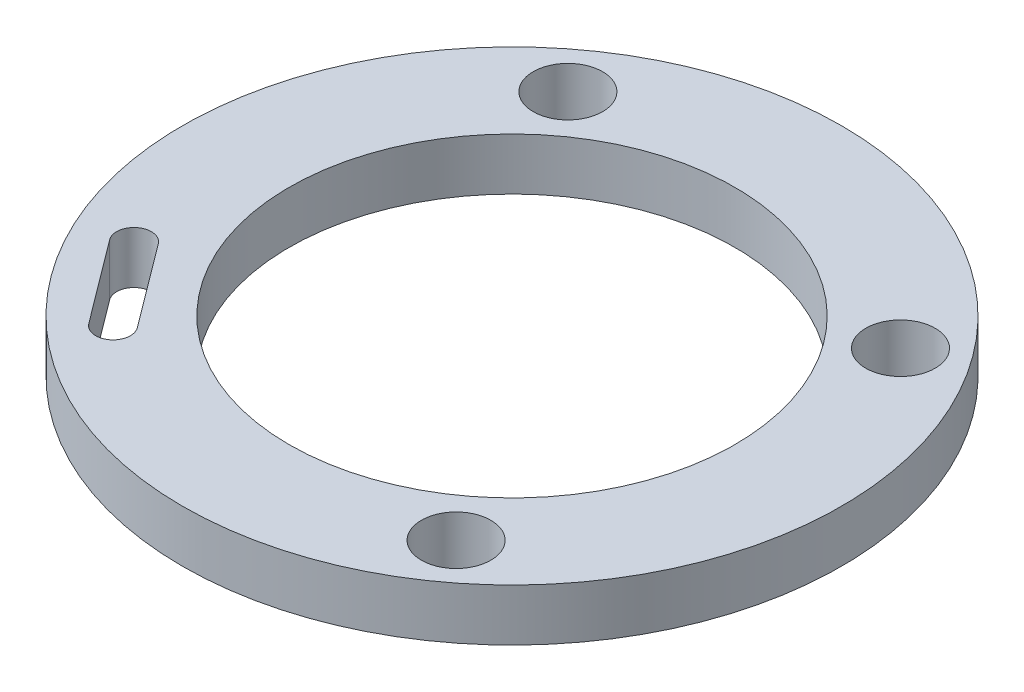
ISO-10303-21;
HEADER;
FILE_DESCRIPTION(('STEP AP214'),'2;1');
FILE_NAME('part.step','',(''),(''),'','','');
FILE_SCHEMA(('AUTOMOTIVE_DESIGN { 1 0 10303 214 1 1 1 1 }'));
ENDSEC;
DATA;
#1=APPLICATION_CONTEXT('core data for automotive mechanical design processes');
#2=APPLICATION_PROTOCOL_DEFINITION('international standard','automotive_design',2000,#1);
#3=PRODUCT_CONTEXT('',#1,'mechanical');
#4=PRODUCT('Part','Part','',(#3));
#5=PRODUCT_RELATED_PRODUCT_CATEGORY('part','',(#4));
#6=PRODUCT_DEFINITION_FORMATION('','',#4);
#7=PRODUCT_DEFINITION_CONTEXT('part definition',#1,'design');
#8=PRODUCT_DEFINITION('design','',#6,#7);
#9=PRODUCT_DEFINITION_SHAPE('','',#8);
#10=(LENGTH_UNIT() NAMED_UNIT(*) SI_UNIT(.MILLI.,.METRE.));
#11=(NAMED_UNIT(*) PLANE_ANGLE_UNIT() SI_UNIT($,.RADIAN.));
#12=(NAMED_UNIT(*) SI_UNIT($,.STERADIAN.) SOLID_ANGLE_UNIT());
#13=UNCERTAINTY_MEASURE_WITH_UNIT(LENGTH_MEASURE(1.E-05),#10,'distance_accuracy_value','');
#14=(GEOMETRIC_REPRESENTATION_CONTEXT(3) GLOBAL_UNCERTAINTY_ASSIGNED_CONTEXT((#13)) GLOBAL_UNIT_ASSIGNED_CONTEXT((#10,
#11,#12)) REPRESENTATION_CONTEXT('',''));
#15=CARTESIAN_POINT('',(0.,0.,0.));
#16=DIRECTION('',(0.,0.,1.));
#17=DIRECTION('',(1.,0.,0.));
#18=AXIS2_PLACEMENT_3D('',#15,#16,#17);
#19=CARTESIAN_POINT('',(0.,3.,0.));
#20=DIRECTION('',(0.,1.,0.));
#21=DIRECTION('',(0.,0.,1.));
#22=AXIS2_PLACEMENT_3D('',#19,#20,#21);
#23=PLANE('',#22);
#24=CARTESIAN_POINT('',(9.58692669075985,3.,12.8097945583056));
#25=DIRECTION('',(0.,1.,0.));
#26=DIRECTION('',(0.,0.,1.));
#27=AXIS2_PLACEMENT_3D('',#24,#25,#26);
#28=CIRCLE('',#27,2.);
#29=CARTESIAN_POINT('',(9.58692669075985,3.,14.8097945583056));
#30=VERTEX_POINT('',#29);
#31=EDGE_CURVE('E110',#30,#30,#28,.T.);
#32=ORIENTED_EDGE('',*,*,#31,.F.);
#33=EDGE_LOOP('',(#32));
#34=FACE_BOUND('',#33,.T.);
#35=CARTESIAN_POINT('',(-9.58692669075985,3.,-12.8097945583056));
#36=DIRECTION('',(0.,1.,0.));
#37=DIRECTION('',(0.,0.,1.));
#38=AXIS2_PLACEMENT_3D('',#35,#36,#37);
#39=CIRCLE('',#38,2.);
#40=CARTESIAN_POINT('',(-9.58692669075985,3.,-10.8097945583056));
#41=VERTEX_POINT('',#40);
#42=EDGE_CURVE('E122',#41,#41,#39,.T.);
#43=ORIENTED_EDGE('',*,*,#42,.F.);
#44=EDGE_LOOP('',(#43));
#45=FACE_BOUND('',#44,.T.);
#46=CARTESIAN_POINT('',(0.,3.,0.));
#47=DIRECTION('',(0.,1.,0.));
#48=DIRECTION('',(0.,0.,1.));
#49=AXIS2_PLACEMENT_3D('',#46,#47,#48);
#50=CIRCLE('',#49,19.);
#51=CARTESIAN_POINT('',(0.,3.,19.));
#52=VERTEX_POINT('',#51);
#53=EDGE_CURVE('E11',#52,#52,#50,.T.);
#54=ORIENTED_EDGE('',*,*,#53,.T.);
#55=EDGE_LOOP('',(#54));
#56=FACE_BOUND('',#55,.T.);
#57=CARTESIAN_POINT('',(0.,3.,0.));
#58=DIRECTION('',(0.,1.,0.));
#59=DIRECTION('',(0.,0.,1.));
#60=AXIS2_PLACEMENT_3D('',#57,#58,#59);
#61=CIRCLE('',#60,12.85);
#62=CARTESIAN_POINT('',(0.,3.,12.85));
#63=VERTEX_POINT('',#62);
#64=EDGE_CURVE('E128',#63,#63,#61,.T.);
#65=ORIENTED_EDGE('',*,*,#64,.F.);
#66=EDGE_LOOP('',(#65));
#67=FACE_BOUND('',#66,.T.);
#68=CARTESIAN_POINT('',(12.8097945583056,3.,-9.58692669075985));
#69=DIRECTION('',(0.,1.,0.));
#70=DIRECTION('',(0.,0.,1.));
#71=AXIS2_PLACEMENT_3D('',#68,#69,#70);
#72=CIRCLE('',#71,2.);
#73=CARTESIAN_POINT('',(12.8097945583056,3.,-7.58692669075985));
#74=VERTEX_POINT('',#73);
#75=EDGE_CURVE('E116',#74,#74,#72,.T.);
#76=ORIENTED_EDGE('',*,*,#75,.F.);
#77=EDGE_LOOP('',(#76));
#78=FACE_BOUND('',#77,.T.);
#79=DIRECTION('',(-0.599182918172491,0.,-0.800612159894101));
#80=VECTOR('',#79,1.);
#81=CARTESIAN_POINT('',(-10.211633643894,3.,11.3895802522697));
#82=LINE('',#81,#80);
#83=CARTESIAN_POINT('',(-10.211633643894,3.,11.3895802522697));
#84=VERTEX_POINT('',#83);
#85=CARTESIAN_POINT('',(-13.806731152929,3.,6.58590729290506));
#86=VERTEX_POINT('',#85);
#87=EDGE_CURVE('E82',#84,#86,#82,.T.);
#88=ORIENTED_EDGE('',*,*,#87,.F.);
#89=CARTESIAN_POINT('',(-11.0122458037881,3.,11.9887631704422));
#90=DIRECTION('',(0.,1.,0.));
#91=DIRECTION('',(0.,0.,1.));
#92=AXIS2_PLACEMENT_3D('',#89,#90,#91);
#93=CIRCLE('',#92,1.);
#94=CARTESIAN_POINT('',(-11.8128579636822,3.,12.5879460886147));
#95=VERTEX_POINT('',#94);
#96=EDGE_CURVE('E74',#95,#84,#93,.T.);
#97=ORIENTED_EDGE('',*,*,#96,.F.);
#98=DIRECTION('',(0.599182918172491,0.,0.800612159894101));
#99=VECTOR('',#98,1.);
#100=CARTESIAN_POINT('',(-11.8128579636822,3.,12.5879460886147));
#101=LINE('',#100,#99);
#102=CARTESIAN_POINT('',(-15.4079554727172,3.,7.78427312925004));
#103=VERTEX_POINT('',#102);
#104=EDGE_CURVE('E96',#103,#95,#101,.T.);
#105=ORIENTED_EDGE('',*,*,#104,.F.);
#106=CARTESIAN_POINT('',(-14.6073433128231,3.,7.18509021107755));
#107=DIRECTION('',(0.,1.,0.));
#108=DIRECTION('',(0.,0.,1.));
#109=AXIS2_PLACEMENT_3D('',#106,#107,#108);
#110=CIRCLE('',#109,1.);
#111=EDGE_CURVE('E94',#86,#103,#110,.T.);
#112=ORIENTED_EDGE('',*,*,#111,.F.);
#113=EDGE_LOOP('',(#88,#97,#105,#112));
#114=FACE_BOUND('',#113,.T.);
#115=ADVANCED_FACE('F33',(#34,#45,#56,#67,#78,#114),#23,.T.);
#116=CARTESIAN_POINT('',(0.,0.,0.));
#117=DIRECTION('',(0.,1.,0.));
#118=DIRECTION('',(0.,0.,1.));
#119=AXIS2_PLACEMENT_3D('',#116,#117,#118);
#120=PLANE('',#119);
#121=CARTESIAN_POINT('',(9.58692669075985,0.,12.8097945583056));
#122=DIRECTION('',(0.,1.,0.));
#123=DIRECTION('',(0.,0.,1.));
#124=AXIS2_PLACEMENT_3D('',#121,#122,#123);
#125=CIRCLE('',#124,2.);
#126=CARTESIAN_POINT('',(9.58692669075985,0.,14.8097945583056));
#127=VERTEX_POINT('',#126);
#128=EDGE_CURVE('E90',#127,#127,#125,.T.);
#129=ORIENTED_EDGE('',*,*,#128,.T.);
#130=EDGE_LOOP('',(#129));
#131=FACE_BOUND('',#130,.T.);
#132=CARTESIAN_POINT('',(-9.58692669075985,0.,-12.8097945583056));
#133=DIRECTION('',(0.,1.,0.));
#134=DIRECTION('',(0.,0.,1.));
#135=AXIS2_PLACEMENT_3D('',#132,#133,#134);
#136=CIRCLE('',#135,2.);
#137=CARTESIAN_POINT('',(-9.58692669075985,0.,-10.8097945583056));
#138=VERTEX_POINT('',#137);
#139=EDGE_CURVE('E119',#138,#138,#136,.T.);
#140=ORIENTED_EDGE('',*,*,#139,.T.);
#141=EDGE_LOOP('',(#140));
#142=FACE_BOUND('',#141,.T.);
#143=CARTESIAN_POINT('',(0.,0.,0.));
#144=DIRECTION('',(0.,1.,0.));
#145=DIRECTION('',(0.,0.,1.));
#146=AXIS2_PLACEMENT_3D('',#143,#144,#145);
#147=CIRCLE('',#146,19.);
#148=CARTESIAN_POINT('',(0.,0.,19.));
#149=VERTEX_POINT('',#148);
#150=EDGE_CURVE('E37',#149,#149,#147,.T.);
#151=ORIENTED_EDGE('',*,*,#150,.F.);
#152=EDGE_LOOP('',(#151));
#153=FACE_BOUND('',#152,.T.);
#154=CARTESIAN_POINT('',(0.,0.,0.));
#155=DIRECTION('',(0.,1.,0.));
#156=DIRECTION('',(0.,0.,1.));
#157=AXIS2_PLACEMENT_3D('',#154,#155,#156);
#158=CIRCLE('',#157,12.85);
#159=CARTESIAN_POINT('',(0.,0.,12.85));
#160=VERTEX_POINT('',#159);
#161=EDGE_CURVE('E125',#160,#160,#158,.T.);
#162=ORIENTED_EDGE('',*,*,#161,.T.);
#163=EDGE_LOOP('',(#162));
#164=FACE_BOUND('',#163,.T.);
#165=CARTESIAN_POINT('',(12.8097945583056,0.,-9.58692669075985));
#166=DIRECTION('',(0.,1.,0.));
#167=DIRECTION('',(0.,0.,1.));
#168=AXIS2_PLACEMENT_3D('',#165,#166,#167);
#169=CIRCLE('',#168,2.);
#170=CARTESIAN_POINT('',(12.8097945583056,0.,-7.58692669075985));
#171=VERTEX_POINT('',#170);
#172=EDGE_CURVE('E113',#171,#171,#169,.T.);
#173=ORIENTED_EDGE('',*,*,#172,.T.);
#174=EDGE_LOOP('',(#173));
#175=FACE_BOUND('',#174,.T.);
#176=CARTESIAN_POINT('',(-11.0122458037881,0.,11.9887631704422));
#177=DIRECTION('',(0.,1.,0.));
#178=DIRECTION('',(0.,0.,1.));
#179=AXIS2_PLACEMENT_3D('',#176,#177,#178);
#180=CIRCLE('',#179,1.);
#181=CARTESIAN_POINT('',(-11.8128579636822,0.,12.5879460886147));
#182=VERTEX_POINT('',#181);
#183=CARTESIAN_POINT('',(-10.211633643894,0.,11.3895802522697));
#184=VERTEX_POINT('',#183);
#185=EDGE_CURVE('E56',#182,#184,#180,.T.);
#186=ORIENTED_EDGE('',*,*,#185,.T.);
#187=DIRECTION('',(-0.599182918172491,0.,-0.800612159894101));
#188=VECTOR('',#187,1.);
#189=CARTESIAN_POINT('',(-10.211633643894,0.,11.3895802522697));
#190=LINE('',#189,#188);
#191=CARTESIAN_POINT('',(-13.806731152929,0.,6.58590729290506));
#192=VERTEX_POINT('',#191);
#193=EDGE_CURVE('E89',#184,#192,#190,.T.);
#194=ORIENTED_EDGE('',*,*,#193,.T.);
#195=CARTESIAN_POINT('',(-14.6073433128231,0.,7.18509021107755));
#196=DIRECTION('',(0.,1.,0.));
#197=DIRECTION('',(0.,0.,1.));
#198=AXIS2_PLACEMENT_3D('',#195,#196,#197);
#199=CIRCLE('',#198,1.);
#200=CARTESIAN_POINT('',(-15.4079554727172,0.,7.78427312925004));
#201=VERTEX_POINT('',#200);
#202=EDGE_CURVE('E102',#192,#201,#199,.T.);
#203=ORIENTED_EDGE('',*,*,#202,.T.);
#204=DIRECTION('',(0.599182918172491,0.,0.800612159894101));
#205=VECTOR('',#204,1.);
#206=CARTESIAN_POINT('',(-11.8128579636822,0.,12.5879460886147));
#207=LINE('',#206,#205);
#208=EDGE_CURVE('E83',#201,#182,#207,.T.);
#209=ORIENTED_EDGE('',*,*,#208,.T.);
#210=EDGE_LOOP('',(#186,#194,#203,#209));
#211=FACE_BOUND('',#210,.T.);
#212=ADVANCED_FACE('F134',(#131,#142,#153,#164,#175,#211),#120,.F.);
#213=CARTESIAN_POINT('',(0.,3.,0.));
#214=DIRECTION('',(0.,-1.,0.));
#215=DIRECTION('',(0.,0.,-1.));
#216=AXIS2_PLACEMENT_3D('',#213,#214,#215);
#217=CYLINDRICAL_SURFACE('',#216,19.);
#218=ORIENTED_EDGE('',*,*,#53,.F.);
#219=EDGE_LOOP('',(#218));
#220=FACE_BOUND('',#219,.T.);
#221=ORIENTED_EDGE('',*,*,#150,.T.);
#222=EDGE_LOOP('',(#221));
#223=FACE_BOUND('',#222,.T.);
#224=ADVANCED_FACE('F35',(#220,#223),#217,.T.);
#225=CARTESIAN_POINT('',(0.,3.,0.));
#226=DIRECTION('',(0.,-1.,0.));
#227=DIRECTION('',(0.,0.,-1.));
#228=AXIS2_PLACEMENT_3D('',#225,#226,#227);
#229=CYLINDRICAL_SURFACE('',#228,12.85);
#230=ORIENTED_EDGE('',*,*,#64,.T.);
#231=EDGE_LOOP('',(#230));
#232=FACE_BOUND('',#231,.T.);
#233=ORIENTED_EDGE('',*,*,#161,.F.);
#234=EDGE_LOOP('',(#233));
#235=FACE_BOUND('',#234,.T.);
#236=ADVANCED_FACE('F137',(#232,#235),#229,.F.);
#237=CARTESIAN_POINT('',(-9.58692669075985,3.,-12.8097945583056));
#238=DIRECTION('',(0.,-1.,0.));
#239=DIRECTION('',(0.,0.,-1.));
#240=AXIS2_PLACEMENT_3D('',#237,#238,#239);
#241=CYLINDRICAL_SURFACE('',#240,2.);
#242=ORIENTED_EDGE('',*,*,#42,.T.);
#243=EDGE_LOOP('',(#242));
#244=FACE_BOUND('',#243,.T.);
#245=ORIENTED_EDGE('',*,*,#139,.F.);
#246=EDGE_LOOP('',(#245));
#247=FACE_BOUND('',#246,.T.);
#248=ADVANCED_FACE('F139',(#244,#247),#241,.F.);
#249=CARTESIAN_POINT('',(12.8097945583056,3.,-9.58692669075985));
#250=DIRECTION('',(0.,-1.,0.));
#251=DIRECTION('',(0.,0.,-1.));
#252=AXIS2_PLACEMENT_3D('',#249,#250,#251);
#253=CYLINDRICAL_SURFACE('',#252,2.);
#254=ORIENTED_EDGE('',*,*,#75,.T.);
#255=EDGE_LOOP('',(#254));
#256=FACE_BOUND('',#255,.T.);
#257=ORIENTED_EDGE('',*,*,#172,.F.);
#258=EDGE_LOOP('',(#257));
#259=FACE_BOUND('',#258,.T.);
#260=ADVANCED_FACE('F146',(#256,#259),#253,.F.);
#261=CARTESIAN_POINT('',(9.58692669075985,3.,12.8097945583056));
#262=DIRECTION('',(0.,-1.,0.));
#263=DIRECTION('',(0.,0.,-1.));
#264=AXIS2_PLACEMENT_3D('',#261,#262,#263);
#265=CYLINDRICAL_SURFACE('',#264,2.);
#266=ORIENTED_EDGE('',*,*,#31,.T.);
#267=EDGE_LOOP('',(#266));
#268=FACE_BOUND('',#267,.T.);
#269=ORIENTED_EDGE('',*,*,#128,.F.);
#270=EDGE_LOOP('',(#269));
#271=FACE_BOUND('',#270,.T.);
#272=ADVANCED_FACE('F169',(#268,#271),#265,.F.);
#273=CARTESIAN_POINT('',(-11.0122458037881,3.,11.9887631704422));
#274=DIRECTION('',(0.,-1.,0.));
#275=DIRECTION('',(0.,0.,-1.));
#276=AXIS2_PLACEMENT_3D('',#273,#274,#275);
#277=CYLINDRICAL_SURFACE('',#276,1.);
#278=ORIENTED_EDGE('',*,*,#185,.F.);
#279=DIRECTION('',(0.,-1.,0.));
#280=VECTOR('',#279,1.);
#281=CARTESIAN_POINT('',(-11.8128579636822,3.,12.5879460886147));
#282=LINE('',#281,#280);
#283=EDGE_CURVE('E78',#95,#182,#282,.T.);
#284=ORIENTED_EDGE('',*,*,#283,.F.);
#285=ORIENTED_EDGE('',*,*,#96,.T.);
#286=DIRECTION('',(0.,-1.,0.));
#287=VECTOR('',#286,1.);
#288=CARTESIAN_POINT('',(-10.211633643894,3.,11.3895802522697));
#289=LINE('',#288,#287);
#290=EDGE_CURVE('E77',#84,#184,#289,.T.);
#291=ORIENTED_EDGE('',*,*,#290,.T.);
#292=EDGE_LOOP('',(#278,#284,#285,#291));
#293=FACE_BOUND('',#292,.T.);
#294=ADVANCED_FACE('F76',(#293),#277,.F.);
#295=CARTESIAN_POINT('',(-10.211633643894,3.,11.3895802522697));
#296=DIRECTION('',(-0.800612159894101,0.,0.599182918172491));
#297=DIRECTION('',(0.599182918172491,0.,0.800612159894102));
#298=AXIS2_PLACEMENT_3D('',#295,#296,#297);
#299=PLANE('',#298);
#300=ORIENTED_EDGE('',*,*,#193,.F.);
#301=ORIENTED_EDGE('',*,*,#290,.F.);
#302=ORIENTED_EDGE('',*,*,#87,.T.);
#303=DIRECTION('',(0.,-1.,0.));
#304=VECTOR('',#303,1.);
#305=CARTESIAN_POINT('',(-13.806731152929,3.,6.58590729290506));
#306=LINE('',#305,#304);
#307=EDGE_CURVE('E91',#86,#192,#306,.T.);
#308=ORIENTED_EDGE('',*,*,#307,.T.);
#309=EDGE_LOOP('',(#300,#301,#302,#308));
#310=FACE_BOUND('',#309,.T.);
#311=ADVANCED_FACE('F86',(#310),#299,.T.);
#312=CARTESIAN_POINT('',(-14.6073433128231,3.,7.18509021107755));
#313=DIRECTION('',(0.,-1.,0.));
#314=DIRECTION('',(0.,0.,-1.));
#315=AXIS2_PLACEMENT_3D('',#312,#313,#314);
#316=CYLINDRICAL_SURFACE('',#315,1.);
#317=ORIENTED_EDGE('',*,*,#202,.F.);
#318=ORIENTED_EDGE('',*,*,#307,.F.);
#319=ORIENTED_EDGE('',*,*,#111,.T.);
#320=DIRECTION('',(0.,-1.,0.));
#321=VECTOR('',#320,1.);
#322=CARTESIAN_POINT('',(-15.4079554727172,3.,7.78427312925004));
#323=LINE('',#322,#321);
#324=EDGE_CURVE('E48',#103,#201,#323,.T.);
#325=ORIENTED_EDGE('',*,*,#324,.T.);
#326=EDGE_LOOP('',(#317,#318,#319,#325));
#327=FACE_BOUND('',#326,.T.);
#328=ADVANCED_FACE('F176',(#327),#316,.F.);
#329=CARTESIAN_POINT('',(-11.8128579636822,3.,12.5879460886147));
#330=DIRECTION('',(0.800612159894101,0.,-0.599182918172491));
#331=DIRECTION('',(-0.599182918172491,0.,-0.800612159894102));
#332=AXIS2_PLACEMENT_3D('',#329,#330,#331);
#333=PLANE('',#332);
#334=ORIENTED_EDGE('',*,*,#208,.F.);
#335=ORIENTED_EDGE('',*,*,#324,.F.);
#336=ORIENTED_EDGE('',*,*,#104,.T.);
#337=ORIENTED_EDGE('',*,*,#283,.T.);
#338=EDGE_LOOP('',(#334,#335,#336,#337));
#339=FACE_BOUND('',#338,.T.);
#340=ADVANCED_FACE('F174',(#339),#333,.T.);
#341=CLOSED_SHELL('',(#115,#212,#224,#236,#248,#260,#272,#294,#311,#328,#340));
#342=MANIFOLD_SOLID_BREP('B2',#341);
#343=ADVANCED_BREP_SHAPE_REPRESENTATION('',(#18,#342),#14);
#344=SHAPE_DEFINITION_REPRESENTATION(#9,#343);
ENDSEC;
END-ISO-10303-21;
